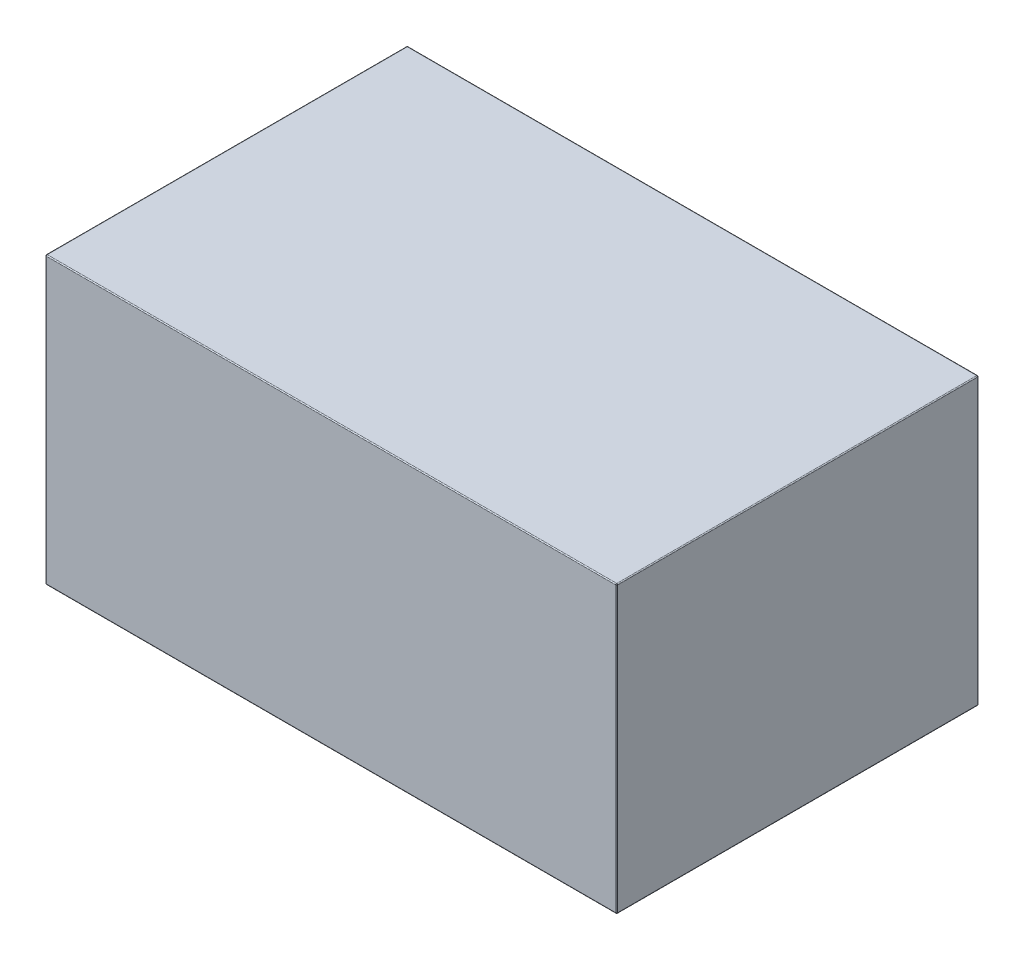
ISO-10303-21;
HEADER;
FILE_DESCRIPTION(('STEP AP214'),'2;1');
FILE_NAME('part.step','',(''),(''),'','','');
FILE_SCHEMA(('AUTOMOTIVE_DESIGN { 1 0 10303 214 1 1 1 1 }'));
ENDSEC;
DATA;
#1=APPLICATION_CONTEXT('core data for automotive mechanical design processes');
#2=APPLICATION_PROTOCOL_DEFINITION('international standard','automotive_design',2000,#1);
#3=PRODUCT_CONTEXT('',#1,'mechanical');
#4=PRODUCT('Part','Part','',(#3));
#5=PRODUCT_RELATED_PRODUCT_CATEGORY('part','',(#4));
#6=PRODUCT_DEFINITION_FORMATION('','',#4);
#7=PRODUCT_DEFINITION_CONTEXT('part definition',#1,'design');
#8=PRODUCT_DEFINITION('design','',#6,#7);
#9=PRODUCT_DEFINITION_SHAPE('','',#8);
#10=(LENGTH_UNIT() NAMED_UNIT(*) SI_UNIT(.MILLI.,.METRE.));
#11=(NAMED_UNIT(*) PLANE_ANGLE_UNIT() SI_UNIT($,.RADIAN.));
#12=(NAMED_UNIT(*) SI_UNIT($,.STERADIAN.) SOLID_ANGLE_UNIT());
#13=UNCERTAINTY_MEASURE_WITH_UNIT(LENGTH_MEASURE(1.E-05),#10,'distance_accuracy_value','');
#14=(GEOMETRIC_REPRESENTATION_CONTEXT(3) GLOBAL_UNCERTAINTY_ASSIGNED_CONTEXT((#13)) GLOBAL_UNIT_ASSIGNED_CONTEXT((#10,
#11,#12)) REPRESENTATION_CONTEXT('',''));
#15=CARTESIAN_POINT('',(0.,0.,0.));
#16=DIRECTION('',(0.,0.,1.));
#17=DIRECTION('',(1.,0.,0.));
#18=AXIS2_PLACEMENT_3D('',#15,#16,#17);
#19=CARTESIAN_POINT('',(76.2,38.1,-48.26));
#20=DIRECTION('',(-1.,0.,0.));
#21=DIRECTION('',(0.,0.,1.));
#22=AXIS2_PLACEMENT_3D('',#19,#20,#21);
#23=PLANE('',#22);
#24=DIRECTION('',(0.,0.,-1.));
#25=VECTOR('',#24,1.);
#26=CARTESIAN_POINT('',(76.2,-37.846,-48.26));
#27=LINE('',#26,#25);
#28=CARTESIAN_POINT('',(76.2,-37.846,48.006));
#29=VERTEX_POINT('',#28);
#30=CARTESIAN_POINT('',(76.2,-37.846,-48.006));
#31=VERTEX_POINT('',#30);
#32=EDGE_CURVE('E253',#29,#31,#27,.T.);
#33=ORIENTED_EDGE('',*,*,#32,.T.);
#34=DIRECTION('',(0.,-1.,0.));
#35=VECTOR('',#34,1.);
#36=CARTESIAN_POINT('',(76.2,38.1,-48.006));
#37=LINE('',#36,#35);
#38=CARTESIAN_POINT('',(76.2,37.846,-48.006));
#39=VERTEX_POINT('',#38);
#40=EDGE_CURVE('E251',#31,#39,#37,.F.);
#41=ORIENTED_EDGE('',*,*,#40,.T.);
#42=DIRECTION('',(0.,0.,-1.));
#43=VECTOR('',#42,1.);
#44=CARTESIAN_POINT('',(76.2,37.846,48.26));
#45=LINE('',#44,#43);
#46=CARTESIAN_POINT('',(76.2,37.846,48.006));
#47=VERTEX_POINT('',#46);
#48=EDGE_CURVE('E243',#39,#47,#45,.F.);
#49=ORIENTED_EDGE('',*,*,#48,.T.);
#50=DIRECTION('',(0.,-1.,0.));
#51=VECTOR('',#50,1.);
#52=CARTESIAN_POINT('',(76.2,38.1,48.006));
#53=LINE('',#52,#51);
#54=EDGE_CURVE('E247',#47,#29,#53,.T.);
#55=ORIENTED_EDGE('',*,*,#54,.T.);
#56=EDGE_LOOP('',(#33,#41,#49,#55));
#57=FACE_BOUND('',#56,.T.);
#58=ADVANCED_FACE('F47',(#57),#23,.F.);
#59=CARTESIAN_POINT('',(-76.2,38.1,-48.26));
#60=DIRECTION('',(0.,0.,1.));
#61=DIRECTION('',(1.,0.,0.));
#62=AXIS2_PLACEMENT_3D('',#59,#60,#61);
#63=PLANE('',#62);
#64=DIRECTION('',(-1.,0.,0.));
#65=VECTOR('',#64,1.);
#66=CARTESIAN_POINT('',(-76.2,-37.846,-48.26));
#67=LINE('',#66,#65);
#68=CARTESIAN_POINT('',(75.946,-37.846,-48.26));
#69=VERTEX_POINT('',#68);
#70=CARTESIAN_POINT('',(-75.946,-37.846,-48.26));
#71=VERTEX_POINT('',#70);
#72=EDGE_CURVE('E334',#69,#71,#67,.T.);
#73=ORIENTED_EDGE('',*,*,#72,.T.);
#74=DIRECTION('',(0.,-1.,0.));
#75=VECTOR('',#74,1.);
#76=CARTESIAN_POINT('',(-75.946,38.1,-48.26));
#77=LINE('',#76,#75);
#78=CARTESIAN_POINT('',(-75.946,37.846,-48.26));
#79=VERTEX_POINT('',#78);
#80=EDGE_CURVE('E248',#71,#79,#77,.F.);
#81=ORIENTED_EDGE('',*,*,#80,.T.);
#82=DIRECTION('',(-1.,0.,0.));
#83=VECTOR('',#82,1.);
#84=CARTESIAN_POINT('',(76.2,37.846,-48.26));
#85=LINE('',#84,#83);
#86=CARTESIAN_POINT('',(75.946,37.846,-48.26));
#87=VERTEX_POINT('',#86);
#88=EDGE_CURVE('E325',#79,#87,#85,.F.);
#89=ORIENTED_EDGE('',*,*,#88,.T.);
#90=DIRECTION('',(0.,-1.,0.));
#91=VECTOR('',#90,1.);
#92=CARTESIAN_POINT('',(75.946,38.1,-48.26));
#93=LINE('',#92,#91);
#94=EDGE_CURVE('E328',#87,#69,#93,.T.);
#95=ORIENTED_EDGE('',*,*,#94,.T.);
#96=EDGE_LOOP('',(#73,#81,#89,#95));
#97=FACE_BOUND('',#96,.T.);
#98=ADVANCED_FACE('F366',(#97),#63,.F.);
#99=CARTESIAN_POINT('',(-76.2,38.1,-48.26));
#100=DIRECTION('',(1.,0.,0.));
#101=DIRECTION('',(0.,0.,-1.));
#102=AXIS2_PLACEMENT_3D('',#99,#100,#101);
#103=PLANE('',#102);
#104=DIRECTION('',(0.,-1.,0.));
#105=VECTOR('',#104,1.);
#106=CARTESIAN_POINT('',(-76.2,38.1,-48.006));
#107=LINE('',#106,#105);
#108=CARTESIAN_POINT('',(-76.2,37.846,-48.006));
#109=VERTEX_POINT('',#108);
#110=CARTESIAN_POINT('',(-76.2,-37.846,-48.006));
#111=VERTEX_POINT('',#110);
#112=EDGE_CURVE('E147',#109,#111,#107,.T.);
#113=ORIENTED_EDGE('',*,*,#112,.T.);
#114=DIRECTION('',(0.,0.,1.));
#115=VECTOR('',#114,1.);
#116=CARTESIAN_POINT('',(-76.2,-37.846,-48.26));
#117=LINE('',#116,#115);
#118=CARTESIAN_POINT('',(-76.2,-37.846,48.006));
#119=VERTEX_POINT('',#118);
#120=EDGE_CURVE('E142',#111,#119,#117,.T.);
#121=ORIENTED_EDGE('',*,*,#120,.T.);
#122=DIRECTION('',(0.,-1.,0.));
#123=VECTOR('',#122,1.);
#124=CARTESIAN_POINT('',(-76.2,38.1,48.006));
#125=LINE('',#124,#123);
#126=CARTESIAN_POINT('',(-76.2,37.846,48.006));
#127=VERTEX_POINT('',#126);
#128=EDGE_CURVE('E136',#119,#127,#125,.F.);
#129=ORIENTED_EDGE('',*,*,#128,.T.);
#130=DIRECTION('',(0.,0.,1.));
#131=VECTOR('',#130,1.);
#132=CARTESIAN_POINT('',(-76.2,37.846,-48.26));
#133=LINE('',#132,#131);
#134=EDGE_CURVE('E139',#127,#109,#133,.F.);
#135=ORIENTED_EDGE('',*,*,#134,.T.);
#136=EDGE_LOOP('',(#113,#121,#129,#135));
#137=FACE_BOUND('',#136,.T.);
#138=ADVANCED_FACE('F138',(#137),#103,.F.);
#139=CARTESIAN_POINT('',(-76.2,38.1,48.26));
#140=DIRECTION('',(0.,0.,-1.));
#141=DIRECTION('',(-1.,0.,0.));
#142=AXIS2_PLACEMENT_3D('',#139,#140,#141);
#143=PLANE('',#142);
#144=DIRECTION('',(0.,-1.,0.));
#145=VECTOR('',#144,1.);
#146=CARTESIAN_POINT('',(-75.946,38.1,48.26));
#147=LINE('',#146,#145);
#148=CARTESIAN_POINT('',(-75.946,37.846,48.26));
#149=VERTEX_POINT('',#148);
#150=CARTESIAN_POINT('',(-75.946,-37.846,48.26));
#151=VERTEX_POINT('',#150);
#152=EDGE_CURVE('E171',#149,#151,#147,.T.);
#153=ORIENTED_EDGE('',*,*,#152,.T.);
#154=DIRECTION('',(1.,0.,0.));
#155=VECTOR('',#154,1.);
#156=CARTESIAN_POINT('',(-76.2,-37.846,48.26));
#157=LINE('',#156,#155);
#158=CARTESIAN_POINT('',(75.946,-37.846,48.26));
#159=VERTEX_POINT('',#158);
#160=EDGE_CURVE('E271',#151,#159,#157,.T.);
#161=ORIENTED_EDGE('',*,*,#160,.T.);
#162=DIRECTION('',(0.,-1.,0.));
#163=VECTOR('',#162,1.);
#164=CARTESIAN_POINT('',(75.946,38.1,48.26));
#165=LINE('',#164,#163);
#166=CARTESIAN_POINT('',(75.946,37.846,48.26));
#167=VERTEX_POINT('',#166);
#168=EDGE_CURVE('E262',#159,#167,#165,.F.);
#169=ORIENTED_EDGE('',*,*,#168,.T.);
#170=DIRECTION('',(1.,0.,0.));
#171=VECTOR('',#170,1.);
#172=CARTESIAN_POINT('',(-76.2,37.846,48.26));
#173=LINE('',#172,#171);
#174=EDGE_CURVE('E258',#167,#149,#173,.F.);
#175=ORIENTED_EDGE('',*,*,#174,.T.);
#176=EDGE_LOOP('',(#153,#161,#169,#175));
#177=FACE_BOUND('',#176,.T.);
#178=ADVANCED_FACE('F550',(#177),#143,.F.);
#179=CARTESIAN_POINT('',(0.,38.1,0.));
#180=DIRECTION('',(0.,1.,0.));
#181=DIRECTION('',(0.,0.,1.));
#182=AXIS2_PLACEMENT_3D('',#179,#180,#181);
#183=PLANE('',#182);
#184=DIRECTION('',(0.,0.,1.));
#185=VECTOR('',#184,1.);
#186=CARTESIAN_POINT('',(-75.946,38.1,48.26));
#187=LINE('',#186,#185);
#188=CARTESIAN_POINT('',(-75.946,38.1,-48.006));
#189=VERTEX_POINT('',#188);
#190=CARTESIAN_POINT('',(-75.946,38.1,48.006));
#191=VERTEX_POINT('',#190);
#192=EDGE_CURVE('E57',#189,#191,#187,.T.);
#193=ORIENTED_EDGE('',*,*,#192,.T.);
#194=DIRECTION('',(1.,0.,0.));
#195=VECTOR('',#194,1.);
#196=CARTESIAN_POINT('',(76.2,38.1,48.006));
#197=LINE('',#196,#195);
#198=CARTESIAN_POINT('',(75.946,38.1,48.006));
#199=VERTEX_POINT('',#198);
#200=EDGE_CURVE('E11',#191,#199,#197,.T.);
#201=ORIENTED_EDGE('',*,*,#200,.T.);
#202=DIRECTION('',(0.,0.,-1.));
#203=VECTOR('',#202,1.);
#204=CARTESIAN_POINT('',(75.946,38.1,-48.26));
#205=LINE('',#204,#203);
#206=CARTESIAN_POINT('',(75.946,38.1,-48.006));
#207=VERTEX_POINT('',#206);
#208=EDGE_CURVE('E274',#199,#207,#205,.T.);
#209=ORIENTED_EDGE('',*,*,#208,.T.);
#210=DIRECTION('',(-1.,0.,0.));
#211=VECTOR('',#210,1.);
#212=CARTESIAN_POINT('',(-76.2,38.1,-48.006));
#213=LINE('',#212,#211);
#214=EDGE_CURVE('E68',#207,#189,#213,.T.);
#215=ORIENTED_EDGE('',*,*,#214,.T.);
#216=EDGE_LOOP('',(#193,#201,#209,#215));
#217=FACE_BOUND('',#216,.T.);
#218=ADVANCED_FACE('F542',(#217),#183,.T.);
#219=CARTESIAN_POINT('',(0.,-38.1,0.));
#220=DIRECTION('',(0.,1.,0.));
#221=DIRECTION('',(0.,0.,1.));
#222=AXIS2_PLACEMENT_3D('',#219,#220,#221);
#223=PLANE('',#222);
#224=DIRECTION('',(1.,0.,0.));
#225=VECTOR('',#224,1.);
#226=CARTESIAN_POINT('',(0.,-38.1,48.006));
#227=LINE('',#226,#225);
#228=CARTESIAN_POINT('',(75.946,-38.1,48.006));
#229=VERTEX_POINT('',#228);
#230=CARTESIAN_POINT('',(-75.946,-38.1,48.006));
#231=VERTEX_POINT('',#230);
#232=EDGE_CURVE('E320',#229,#231,#227,.F.);
#233=ORIENTED_EDGE('',*,*,#232,.T.);
#234=DIRECTION('',(0.,0.,1.));
#235=VECTOR('',#234,1.);
#236=CARTESIAN_POINT('',(-75.946,-38.1,0.));
#237=LINE('',#236,#235);
#238=CARTESIAN_POINT('',(-75.946,-38.1,-48.006));
#239=VERTEX_POINT('',#238);
#240=EDGE_CURVE('E314',#231,#239,#237,.F.);
#241=ORIENTED_EDGE('',*,*,#240,.T.);
#242=DIRECTION('',(-1.,0.,0.));
#243=VECTOR('',#242,1.);
#244=CARTESIAN_POINT('',(0.,-38.1,-48.006));
#245=LINE('',#244,#243);
#246=CARTESIAN_POINT('',(75.946,-38.1,-48.006));
#247=VERTEX_POINT('',#246);
#248=EDGE_CURVE('E307',#239,#247,#245,.F.);
#249=ORIENTED_EDGE('',*,*,#248,.T.);
#250=DIRECTION('',(0.,0.,-1.));
#251=VECTOR('',#250,1.);
#252=CARTESIAN_POINT('',(75.946,-38.1,0.));
#253=LINE('',#252,#251);
#254=EDGE_CURVE('E315',#247,#229,#253,.F.);
#255=ORIENTED_EDGE('',*,*,#254,.T.);
#256=EDGE_LOOP('',(#233,#241,#249,#255));
#257=FACE_BOUND('',#256,.T.);
#258=ADVANCED_FACE('F318',(#257),#223,.F.);
#259=CARTESIAN_POINT('',(75.946,37.846,0.));
#260=DIRECTION('',(0.,0.,1.));
#261=DIRECTION('',(1.,0.,0.));
#262=AXIS2_PLACEMENT_3D('',#259,#260,#261);
#263=CYLINDRICAL_SURFACE('',#262,0.254);
#264=CARTESIAN_POINT('',(75.946,37.846,-48.006));
#265=DIRECTION('',(0.,0.,-1.));
#266=DIRECTION('',(-1.,0.,0.));
#267=AXIS2_PLACEMENT_3D('',#264,#265,#266);
#268=CIRCLE('',#267,0.254);
#269=EDGE_CURVE('E51',#207,#39,#268,.T.);
#270=ORIENTED_EDGE('',*,*,#269,.F.);
#271=ORIENTED_EDGE('',*,*,#208,.F.);
#272=CARTESIAN_POINT('',(75.946,37.846,48.006));
#273=DIRECTION('',(0.,0.,1.));
#274=DIRECTION('',(0.,-1.,0.));
#275=AXIS2_PLACEMENT_3D('',#272,#273,#274);
#276=CIRCLE('',#275,0.254);
#277=EDGE_CURVE('E225',#47,#199,#276,.T.);
#278=ORIENTED_EDGE('',*,*,#277,.F.);
#279=ORIENTED_EDGE('',*,*,#48,.F.);
#280=EDGE_LOOP('',(#270,#271,#278,#279));
#281=FACE_BOUND('',#280,.T.);
#282=ADVANCED_FACE('F49',(#281),#263,.T.);
#283=CARTESIAN_POINT('',(75.946,37.846,-48.006));
#284=DIRECTION('',(1.,0.,0.));
#285=DIRECTION('',(0.,0.,-1.));
#286=AXIS2_PLACEMENT_3D('',#283,#284,#285);
#287=SPHERICAL_SURFACE('',#286,0.254);
#288=CARTESIAN_POINT('',(75.946,37.846,-48.006));
#289=DIRECTION('',(1.,0.,0.));
#290=DIRECTION('',(0.,0.,-1.));
#291=AXIS2_PLACEMENT_3D('',#288,#289,#290);
#292=CIRCLE('',#291,0.254);
#293=EDGE_CURVE('E219',#207,#87,#292,.F.);
#294=ORIENTED_EDGE('',*,*,#293,.F.);
#295=ORIENTED_EDGE('',*,*,#269,.T.);
#296=CARTESIAN_POINT('',(75.946,37.846,-48.006));
#297=DIRECTION('',(0.,1.,0.));
#298=DIRECTION('',(0.,0.,1.));
#299=AXIS2_PLACEMENT_3D('',#296,#297,#298);
#300=CIRCLE('',#299,0.254);
#301=EDGE_CURVE('E223',#87,#39,#300,.F.);
#302=ORIENTED_EDGE('',*,*,#301,.F.);
#303=EDGE_LOOP('',(#294,#295,#302));
#304=FACE_BOUND('',#303,.T.);
#305=ADVANCED_FACE('F240',(#304),#287,.T.);
#306=CARTESIAN_POINT('',(75.946,37.846,48.006));
#307=DIRECTION('',(0.,1.,0.));
#308=DIRECTION('',(0.,0.,1.));
#309=AXIS2_PLACEMENT_3D('',#306,#307,#308);
#310=SPHERICAL_SURFACE('',#309,0.254);
#311=CARTESIAN_POINT('',(75.946,37.846,48.006));
#312=DIRECTION('',(0.,1.,0.));
#313=DIRECTION('',(0.,0.,1.));
#314=AXIS2_PLACEMENT_3D('',#311,#312,#313);
#315=CIRCLE('',#314,0.254);
#316=EDGE_CURVE('E212',#47,#167,#315,.F.);
#317=ORIENTED_EDGE('',*,*,#316,.F.);
#318=ORIENTED_EDGE('',*,*,#277,.T.);
#319=CARTESIAN_POINT('',(75.946,37.846,48.006));
#320=DIRECTION('',(1.,0.,0.));
#321=DIRECTION('',(0.,0.,-1.));
#322=AXIS2_PLACEMENT_3D('',#319,#320,#321);
#323=CIRCLE('',#322,0.254);
#324=EDGE_CURVE('E216',#167,#199,#323,.F.);
#325=ORIENTED_EDGE('',*,*,#324,.F.);
#326=EDGE_LOOP('',(#317,#318,#325));
#327=FACE_BOUND('',#326,.T.);
#328=ADVANCED_FACE('F515',(#327),#310,.T.);
#329=CARTESIAN_POINT('',(75.946,38.1,-48.006));
#330=DIRECTION('',(0.,-1.,0.));
#331=DIRECTION('',(0.,0.,-1.));
#332=AXIS2_PLACEMENT_3D('',#329,#330,#331);
#333=CYLINDRICAL_SURFACE('',#332,0.254);
#334=ORIENTED_EDGE('',*,*,#301,.T.);
#335=ORIENTED_EDGE('',*,*,#40,.F.);
#336=CARTESIAN_POINT('',(75.946,-37.846,-48.006));
#337=DIRECTION('',(0.,-1.,0.));
#338=DIRECTION('',(0.,0.,-1.));
#339=AXIS2_PLACEMENT_3D('',#336,#337,#338);
#340=CIRCLE('',#339,0.254);
#341=EDGE_CURVE('E204',#69,#31,#340,.T.);
#342=ORIENTED_EDGE('',*,*,#341,.F.);
#343=ORIENTED_EDGE('',*,*,#94,.F.);
#344=EDGE_LOOP('',(#334,#335,#342,#343));
#345=FACE_BOUND('',#344,.T.);
#346=ADVANCED_FACE('F368',(#345),#333,.T.);
#347=CARTESIAN_POINT('',(0.,37.846,-48.006));
#348=DIRECTION('',(1.,0.,0.));
#349=DIRECTION('',(0.,0.,-1.));
#350=AXIS2_PLACEMENT_3D('',#347,#348,#349);
#351=CYLINDRICAL_SURFACE('',#350,0.254);
#352=ORIENTED_EDGE('',*,*,#293,.T.);
#353=ORIENTED_EDGE('',*,*,#88,.F.);
#354=CARTESIAN_POINT('',(-75.946,37.846,-48.006));
#355=DIRECTION('',(-1.,0.,0.));
#356=DIRECTION('',(0.,0.,1.));
#357=AXIS2_PLACEMENT_3D('',#354,#355,#356);
#358=CIRCLE('',#357,0.254);
#359=EDGE_CURVE('E200',#189,#79,#358,.T.);
#360=ORIENTED_EDGE('',*,*,#359,.F.);
#361=ORIENTED_EDGE('',*,*,#214,.F.);
#362=EDGE_LOOP('',(#352,#353,#360,#361));
#363=FACE_BOUND('',#362,.T.);
#364=ADVANCED_FACE('F499',(#363),#351,.T.);
#365=CARTESIAN_POINT('',(-75.946,37.846,0.));
#366=DIRECTION('',(0.,0.,-1.));
#367=DIRECTION('',(-1.,0.,0.));
#368=AXIS2_PLACEMENT_3D('',#365,#366,#367);
#369=CYLINDRICAL_SURFACE('',#368,0.254);
#370=CARTESIAN_POINT('',(-75.946,37.846,48.006));
#371=DIRECTION('',(0.,0.,1.));
#372=DIRECTION('',(1.,0.,0.));
#373=AXIS2_PLACEMENT_3D('',#370,#371,#372);
#374=CIRCLE('',#373,0.254);
#375=EDGE_CURVE('E153',#191,#127,#374,.T.);
#376=ORIENTED_EDGE('',*,*,#375,.F.);
#377=ORIENTED_EDGE('',*,*,#192,.F.);
#378=CARTESIAN_POINT('',(-75.946,37.846,-48.006));
#379=DIRECTION('',(0.,0.,-1.));
#380=DIRECTION('',(-1.,0.,0.));
#381=AXIS2_PLACEMENT_3D('',#378,#379,#380);
#382=CIRCLE('',#381,0.254);
#383=EDGE_CURVE('E156',#109,#189,#382,.T.);
#384=ORIENTED_EDGE('',*,*,#383,.F.);
#385=ORIENTED_EDGE('',*,*,#134,.F.);
#386=EDGE_LOOP('',(#376,#377,#384,#385));
#387=FACE_BOUND('',#386,.T.);
#388=ADVANCED_FACE('F152',(#387),#369,.T.);
#389=CARTESIAN_POINT('',(0.,37.846,48.006));
#390=DIRECTION('',(-1.,0.,0.));
#391=DIRECTION('',(0.,0.,1.));
#392=AXIS2_PLACEMENT_3D('',#389,#390,#391);
#393=CYLINDRICAL_SURFACE('',#392,0.254);
#394=ORIENTED_EDGE('',*,*,#324,.T.);
#395=ORIENTED_EDGE('',*,*,#200,.F.);
#396=CARTESIAN_POINT('',(-75.946,37.846,48.006));
#397=DIRECTION('',(-1.,0.,0.));
#398=DIRECTION('',(0.,-1.,0.));
#399=AXIS2_PLACEMENT_3D('',#396,#397,#398);
#400=CIRCLE('',#399,0.254);
#401=EDGE_CURVE('E166',#149,#191,#400,.T.);
#402=ORIENTED_EDGE('',*,*,#401,.F.);
#403=ORIENTED_EDGE('',*,*,#174,.F.);
#404=EDGE_LOOP('',(#394,#395,#402,#403));
#405=FACE_BOUND('',#404,.T.);
#406=ADVANCED_FACE('F483',(#405),#393,.T.);
#407=CARTESIAN_POINT('',(75.946,38.1,48.006));
#408=DIRECTION('',(0.,-1.,0.));
#409=DIRECTION('',(0.,0.,-1.));
#410=AXIS2_PLACEMENT_3D('',#407,#408,#409);
#411=CYLINDRICAL_SURFACE('',#410,0.254);
#412=ORIENTED_EDGE('',*,*,#316,.T.);
#413=ORIENTED_EDGE('',*,*,#168,.F.);
#414=CARTESIAN_POINT('',(75.946,-37.846,48.006));
#415=DIRECTION('',(0.,-1.,0.));
#416=DIRECTION('',(0.,0.,-1.));
#417=AXIS2_PLACEMENT_3D('',#414,#415,#416);
#418=CIRCLE('',#417,0.254);
#419=EDGE_CURVE('E192',#29,#159,#418,.T.);
#420=ORIENTED_EDGE('',*,*,#419,.F.);
#421=ORIENTED_EDGE('',*,*,#54,.F.);
#422=EDGE_LOOP('',(#412,#413,#420,#421));
#423=FACE_BOUND('',#422,.T.);
#424=ADVANCED_FACE('F348',(#423),#411,.T.);
#425=CARTESIAN_POINT('',(75.946,-37.846,-48.26));
#426=DIRECTION('',(0.,0.,-1.));
#427=DIRECTION('',(-1.,0.,0.));
#428=AXIS2_PLACEMENT_3D('',#425,#426,#427);
#429=CYLINDRICAL_SURFACE('',#428,0.254);
#430=CARTESIAN_POINT('',(75.946,-37.846,-48.006));
#431=DIRECTION('',(0.,0.,-1.));
#432=DIRECTION('',(-1.,0.,0.));
#433=AXIS2_PLACEMENT_3D('',#430,#431,#432);
#434=CIRCLE('',#433,0.254);
#435=EDGE_CURVE('E208',#31,#247,#434,.T.);
#436=ORIENTED_EDGE('',*,*,#435,.F.);
#437=ORIENTED_EDGE('',*,*,#32,.F.);
#438=CARTESIAN_POINT('',(75.946,-37.846,48.006));
#439=DIRECTION('',(0.,0.,1.));
#440=DIRECTION('',(1.,0.,0.));
#441=AXIS2_PLACEMENT_3D('',#438,#439,#440);
#442=CIRCLE('',#441,0.254);
#443=EDGE_CURVE('E188',#229,#29,#442,.T.);
#444=ORIENTED_EDGE('',*,*,#443,.F.);
#445=ORIENTED_EDGE('',*,*,#254,.F.);
#446=EDGE_LOOP('',(#436,#437,#444,#445));
#447=FACE_BOUND('',#446,.T.);
#448=ADVANCED_FACE('F345',(#447),#429,.T.);
#449=CARTESIAN_POINT('',(75.946,-37.846,-48.006));
#450=DIRECTION('',(1.,0.,0.));
#451=DIRECTION('',(0.,1.,0.));
#452=AXIS2_PLACEMENT_3D('',#449,#450,#451);
#453=SPHERICAL_SURFACE('',#452,0.254);
#454=ORIENTED_EDGE('',*,*,#341,.T.);
#455=ORIENTED_EDGE('',*,*,#435,.T.);
#456=CARTESIAN_POINT('',(75.946,-37.846,-48.006));
#457=DIRECTION('',(1.,0.,0.));
#458=DIRECTION('',(0.,0.,-1.));
#459=AXIS2_PLACEMENT_3D('',#456,#457,#458);
#460=CIRCLE('',#459,0.254);
#461=EDGE_CURVE('E178',#69,#247,#460,.F.);
#462=ORIENTED_EDGE('',*,*,#461,.F.);
#463=EDGE_LOOP('',(#454,#455,#462));
#464=FACE_BOUND('',#463,.T.);
#465=ADVANCED_FACE('F370',(#464),#453,.T.);
#466=CARTESIAN_POINT('',(-75.946,37.846,-48.006));
#467=DIRECTION('',(0.,1.,0.));
#468=DIRECTION('',(-1.,0.,0.));
#469=AXIS2_PLACEMENT_3D('',#466,#467,#468);
#470=SPHERICAL_SURFACE('',#469,0.254);
#471=ORIENTED_EDGE('',*,*,#383,.T.);
#472=ORIENTED_EDGE('',*,*,#359,.T.);
#473=CARTESIAN_POINT('',(-75.946,37.846,-48.006));
#474=DIRECTION('',(0.,1.,0.));
#475=DIRECTION('',(0.,0.,1.));
#476=AXIS2_PLACEMENT_3D('',#473,#474,#475);
#477=CIRCLE('',#476,0.254);
#478=EDGE_CURVE('E173',#109,#79,#477,.F.);
#479=ORIENTED_EDGE('',*,*,#478,.F.);
#480=EDGE_LOOP('',(#471,#472,#479));
#481=FACE_BOUND('',#480,.T.);
#482=ADVANCED_FACE('F372',(#481),#470,.T.);
#483=CARTESIAN_POINT('',(-75.946,37.846,48.006));
#484=DIRECTION('',(0.,1.,0.));
#485=DIRECTION('',(-1.,0.,0.));
#486=AXIS2_PLACEMENT_3D('',#483,#484,#485);
#487=SPHERICAL_SURFACE('',#486,0.254);
#488=ORIENTED_EDGE('',*,*,#401,.T.);
#489=ORIENTED_EDGE('',*,*,#375,.T.);
#490=CARTESIAN_POINT('',(-75.946,37.846,48.006));
#491=DIRECTION('',(0.,1.,0.));
#492=DIRECTION('',(0.,0.,1.));
#493=AXIS2_PLACEMENT_3D('',#490,#491,#492);
#494=CIRCLE('',#493,0.254);
#495=EDGE_CURVE('E163',#149,#127,#494,.F.);
#496=ORIENTED_EDGE('',*,*,#495,.F.);
#497=EDGE_LOOP('',(#488,#489,#496));
#498=FACE_BOUND('',#497,.T.);
#499=ADVANCED_FACE('F162',(#498),#487,.T.);
#500=CARTESIAN_POINT('',(75.946,-37.846,48.006));
#501=DIRECTION('',(1.,0.,0.));
#502=DIRECTION('',(0.,0.,-1.));
#503=AXIS2_PLACEMENT_3D('',#500,#501,#502);
#504=SPHERICAL_SURFACE('',#503,0.254);
#505=ORIENTED_EDGE('',*,*,#443,.T.);
#506=ORIENTED_EDGE('',*,*,#419,.T.);
#507=CARTESIAN_POINT('',(75.946,-37.846,48.006));
#508=DIRECTION('',(1.,0.,0.));
#509=DIRECTION('',(0.,0.,-1.));
#510=AXIS2_PLACEMENT_3D('',#507,#508,#509);
#511=CIRCLE('',#510,0.254);
#512=EDGE_CURVE('E174',#229,#159,#511,.F.);
#513=ORIENTED_EDGE('',*,*,#512,.F.);
#514=EDGE_LOOP('',(#505,#506,#513));
#515=FACE_BOUND('',#514,.T.);
#516=ADVANCED_FACE('F350',(#515),#504,.T.);
#517=CARTESIAN_POINT('',(-76.2,-37.846,-48.006));
#518=DIRECTION('',(-1.,0.,0.));
#519=DIRECTION('',(0.,0.,1.));
#520=AXIS2_PLACEMENT_3D('',#517,#518,#519);
#521=CYLINDRICAL_SURFACE('',#520,0.254);
#522=ORIENTED_EDGE('',*,*,#461,.T.);
#523=ORIENTED_EDGE('',*,*,#248,.F.);
#524=CARTESIAN_POINT('',(-75.946,-37.846,-48.006));
#525=DIRECTION('',(-1.,0.,0.));
#526=DIRECTION('',(0.,0.,1.));
#527=AXIS2_PLACEMENT_3D('',#524,#525,#526);
#528=CIRCLE('',#527,0.254);
#529=EDGE_CURVE('E181',#71,#239,#528,.T.);
#530=ORIENTED_EDGE('',*,*,#529,.F.);
#531=ORIENTED_EDGE('',*,*,#72,.F.);
#532=EDGE_LOOP('',(#522,#523,#530,#531));
#533=FACE_BOUND('',#532,.T.);
#534=ADVANCED_FACE('F309',(#533),#521,.T.);
#535=CARTESIAN_POINT('',(-75.946,38.1,-48.006));
#536=DIRECTION('',(0.,-1.,0.));
#537=DIRECTION('',(0.,0.,-1.));
#538=AXIS2_PLACEMENT_3D('',#535,#536,#537);
#539=CYLINDRICAL_SURFACE('',#538,0.254);
#540=ORIENTED_EDGE('',*,*,#478,.T.);
#541=ORIENTED_EDGE('',*,*,#80,.F.);
#542=CARTESIAN_POINT('',(-75.946,-37.846,-48.006));
#543=DIRECTION('',(0.,-1.,0.));
#544=DIRECTION('',(0.,0.,-1.));
#545=AXIS2_PLACEMENT_3D('',#542,#543,#544);
#546=CIRCLE('',#545,0.254);
#547=EDGE_CURVE('E294',#111,#71,#546,.T.);
#548=ORIENTED_EDGE('',*,*,#547,.F.);
#549=ORIENTED_EDGE('',*,*,#112,.F.);
#550=EDGE_LOOP('',(#540,#541,#548,#549));
#551=FACE_BOUND('',#550,.T.);
#552=ADVANCED_FACE('F364',(#551),#539,.T.);
#553=CARTESIAN_POINT('',(-75.946,38.1,48.006));
#554=DIRECTION('',(0.,-1.,0.));
#555=DIRECTION('',(0.,0.,-1.));
#556=AXIS2_PLACEMENT_3D('',#553,#554,#555);
#557=CYLINDRICAL_SURFACE('',#556,0.254);
#558=ORIENTED_EDGE('',*,*,#495,.T.);
#559=ORIENTED_EDGE('',*,*,#128,.F.);
#560=CARTESIAN_POINT('',(-75.946,-37.846,48.006));
#561=DIRECTION('',(0.,-1.,0.));
#562=DIRECTION('',(0.,0.,-1.));
#563=AXIS2_PLACEMENT_3D('',#560,#561,#562);
#564=CIRCLE('',#563,0.254);
#565=EDGE_CURVE('E290',#151,#119,#564,.T.);
#566=ORIENTED_EDGE('',*,*,#565,.F.);
#567=ORIENTED_EDGE('',*,*,#152,.F.);
#568=EDGE_LOOP('',(#558,#559,#566,#567));
#569=FACE_BOUND('',#568,.T.);
#570=ADVANCED_FACE('F169',(#569),#557,.T.);
#571=CARTESIAN_POINT('',(-76.2,-37.846,48.006));
#572=DIRECTION('',(1.,0.,0.));
#573=DIRECTION('',(0.,0.,-1.));
#574=AXIS2_PLACEMENT_3D('',#571,#572,#573);
#575=CYLINDRICAL_SURFACE('',#574,0.254);
#576=ORIENTED_EDGE('',*,*,#512,.T.);
#577=ORIENTED_EDGE('',*,*,#160,.F.);
#578=CARTESIAN_POINT('',(-75.946,-37.846,48.006));
#579=DIRECTION('',(-1.,0.,0.));
#580=DIRECTION('',(0.,0.,1.));
#581=AXIS2_PLACEMENT_3D('',#578,#579,#580);
#582=CIRCLE('',#581,0.254);
#583=EDGE_CURVE('E287',#231,#151,#582,.T.);
#584=ORIENTED_EDGE('',*,*,#583,.F.);
#585=ORIENTED_EDGE('',*,*,#232,.F.);
#586=EDGE_LOOP('',(#576,#577,#584,#585));
#587=FACE_BOUND('',#586,.T.);
#588=ADVANCED_FACE('F353',(#587),#575,.T.);
#589=CARTESIAN_POINT('',(-75.946,-37.846,-48.006));
#590=DIRECTION('',(0.,0.,-1.));
#591=DIRECTION('',(0.,1.,0.));
#592=AXIS2_PLACEMENT_3D('',#589,#590,#591);
#593=SPHERICAL_SURFACE('',#592,0.254);
#594=ORIENTED_EDGE('',*,*,#547,.T.);
#595=ORIENTED_EDGE('',*,*,#529,.T.);
#596=CARTESIAN_POINT('',(-75.946,-37.846,-48.006));
#597=DIRECTION('',(0.,0.,-1.));
#598=DIRECTION('',(-1.,0.,0.));
#599=AXIS2_PLACEMENT_3D('',#596,#597,#598);
#600=CIRCLE('',#599,0.254);
#601=EDGE_CURVE('E284',#111,#239,#600,.F.);
#602=ORIENTED_EDGE('',*,*,#601,.F.);
#603=EDGE_LOOP('',(#594,#595,#602));
#604=FACE_BOUND('',#603,.T.);
#605=ADVANCED_FACE('F303',(#604),#593,.T.);
#606=CARTESIAN_POINT('',(-75.946,-37.846,48.006));
#607=DIRECTION('',(0.,0.,1.));
#608=DIRECTION('',(0.,-1.,0.));
#609=AXIS2_PLACEMENT_3D('',#606,#607,#608);
#610=SPHERICAL_SURFACE('',#609,0.254);
#611=ORIENTED_EDGE('',*,*,#583,.T.);
#612=ORIENTED_EDGE('',*,*,#565,.T.);
#613=CARTESIAN_POINT('',(-75.946,-37.846,48.006));
#614=DIRECTION('',(0.,0.,1.));
#615=DIRECTION('',(1.,0.,0.));
#616=AXIS2_PLACEMENT_3D('',#613,#614,#615);
#617=CIRCLE('',#616,0.254);
#618=EDGE_CURVE('E281',#231,#119,#617,.F.);
#619=ORIENTED_EDGE('',*,*,#618,.F.);
#620=EDGE_LOOP('',(#611,#612,#619));
#621=FACE_BOUND('',#620,.T.);
#622=ADVANCED_FACE('F392',(#621),#610,.T.);
#623=CARTESIAN_POINT('',(-75.946,-37.846,-48.26));
#624=DIRECTION('',(0.,0.,1.));
#625=DIRECTION('',(1.,0.,0.));
#626=AXIS2_PLACEMENT_3D('',#623,#624,#625);
#627=CYLINDRICAL_SURFACE('',#626,0.254);
#628=ORIENTED_EDGE('',*,*,#601,.T.);
#629=ORIENTED_EDGE('',*,*,#240,.F.);
#630=ORIENTED_EDGE('',*,*,#618,.T.);
#631=ORIENTED_EDGE('',*,*,#120,.F.);
#632=EDGE_LOOP('',(#628,#629,#630,#631));
#633=FACE_BOUND('',#632,.T.);
#634=ADVANCED_FACE('F389',(#633),#627,.T.);
#635=CLOSED_SHELL('',(#58,#98,#138,#178,#218,#258,#282,#305,#328,#346,#364,#388,#406,#424,#448,
#465,#482,#499,#516,#534,#552,#570,#588,#605,#622,#634));
#636=MANIFOLD_SOLID_BREP('B2',#635);
#637=ADVANCED_BREP_SHAPE_REPRESENTATION('',(#18,#636),#14);
#638=SHAPE_DEFINITION_REPRESENTATION(#9,#637);
ENDSEC;
END-ISO-10303-21;
